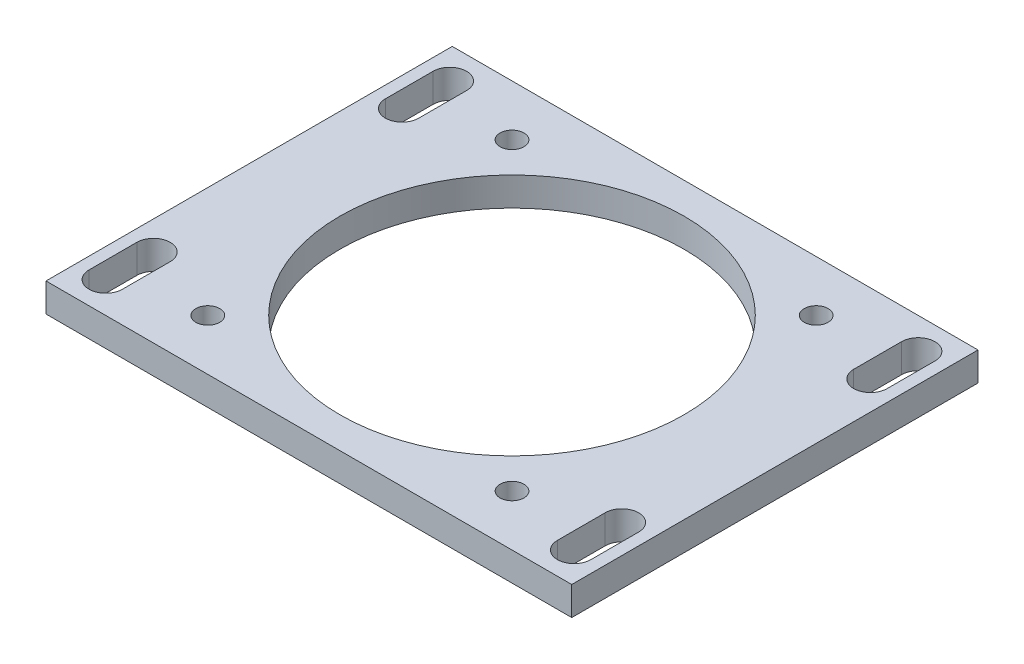
ISO-10303-21;
HEADER;
FILE_DESCRIPTION(('STEP AP214'),'2;1');
FILE_NAME('part.step','',(''),(''),'','','');
FILE_SCHEMA(('AUTOMOTIVE_DESIGN { 1 0 10303 214 1 1 1 1 }'));
ENDSEC;
DATA;
#1=APPLICATION_CONTEXT('core data for automotive mechanical design processes');
#2=APPLICATION_PROTOCOL_DEFINITION('international standard','automotive_design',2000,#1);
#3=PRODUCT_CONTEXT('',#1,'mechanical');
#4=PRODUCT('Part','Part','',(#3));
#5=PRODUCT_RELATED_PRODUCT_CATEGORY('part','',(#4));
#6=PRODUCT_DEFINITION_FORMATION('','',#4);
#7=PRODUCT_DEFINITION_CONTEXT('part definition',#1,'design');
#8=PRODUCT_DEFINITION('design','',#6,#7);
#9=PRODUCT_DEFINITION_SHAPE('','',#8);
#10=(LENGTH_UNIT() NAMED_UNIT(*) SI_UNIT(.MILLI.,.METRE.));
#11=(NAMED_UNIT(*) PLANE_ANGLE_UNIT() SI_UNIT($,.RADIAN.));
#12=(NAMED_UNIT(*) SI_UNIT($,.STERADIAN.) SOLID_ANGLE_UNIT());
#13=UNCERTAINTY_MEASURE_WITH_UNIT(LENGTH_MEASURE(1.E-05),#10,'distance_accuracy_value','');
#14=(GEOMETRIC_REPRESENTATION_CONTEXT(3) GLOBAL_UNCERTAINTY_ASSIGNED_CONTEXT((#13)) GLOBAL_UNIT_ASSIGNED_CONTEXT((#10,
#11,#12)) REPRESENTATION_CONTEXT('',''));
#15=CARTESIAN_POINT('',(0.,0.,0.));
#16=DIRECTION('',(0.,0.,1.));
#17=DIRECTION('',(1.,0.,0.));
#18=AXIS2_PLACEMENT_3D('',#15,#16,#17);
#19=CARTESIAN_POINT('',(55.,6.,-42.5));
#20=DIRECTION('',(-1.,0.,0.));
#21=DIRECTION('',(0.,0.,1.));
#22=AXIS2_PLACEMENT_3D('',#19,#20,#21);
#23=PLANE('',#22);
#24=DIRECTION('',(0.,0.,-1.));
#25=VECTOR('',#24,1.);
#26=CARTESIAN_POINT('',(55.,0.,-42.5));
#27=LINE('',#26,#25);
#28=CARTESIAN_POINT('',(55.,0.,42.5));
#29=VERTEX_POINT('',#28);
#30=CARTESIAN_POINT('',(55.,0.,-42.5));
#31=VERTEX_POINT('',#30);
#32=EDGE_CURVE('E288',#29,#31,#27,.T.);
#33=ORIENTED_EDGE('',*,*,#32,.T.);
#34=DIRECTION('',(0.,-1.,0.));
#35=VECTOR('',#34,1.);
#36=CARTESIAN_POINT('',(55.,6.,-42.5));
#37=LINE('',#36,#35);
#38=CARTESIAN_POINT('',(55.,6.,-42.5));
#39=VERTEX_POINT('',#38);
#40=EDGE_CURVE('E304',#39,#31,#37,.T.);
#41=ORIENTED_EDGE('',*,*,#40,.F.);
#42=DIRECTION('',(0.,0.,-1.));
#43=VECTOR('',#42,1.);
#44=CARTESIAN_POINT('',(55.,6.,-42.5));
#45=LINE('',#44,#43);
#46=CARTESIAN_POINT('',(55.,6.,42.5));
#47=VERTEX_POINT('',#46);
#48=EDGE_CURVE('E277',#47,#39,#45,.T.);
#49=ORIENTED_EDGE('',*,*,#48,.F.);
#50=DIRECTION('',(0.,-1.,0.));
#51=VECTOR('',#50,1.);
#52=CARTESIAN_POINT('',(55.,6.,42.5));
#53=LINE('',#52,#51);
#54=EDGE_CURVE('E287',#47,#29,#53,.T.);
#55=ORIENTED_EDGE('',*,*,#54,.T.);
#56=EDGE_LOOP('',(#33,#41,#49,#55));
#57=FACE_BOUND('',#56,.T.);
#58=ADVANCED_FACE('F42',(#57),#23,.F.);
#59=CARTESIAN_POINT('',(-55.,6.,-42.5));
#60=DIRECTION('',(0.,0.,1.));
#61=DIRECTION('',(1.,0.,0.));
#62=AXIS2_PLACEMENT_3D('',#59,#60,#61);
#63=PLANE('',#62);
#64=DIRECTION('',(-1.,0.,0.));
#65=VECTOR('',#64,1.);
#66=CARTESIAN_POINT('',(-55.,0.,-42.5));
#67=LINE('',#66,#65);
#68=CARTESIAN_POINT('',(-55.,0.,-42.5));
#69=VERTEX_POINT('',#68);
#70=EDGE_CURVE('E291',#31,#69,#67,.T.);
#71=ORIENTED_EDGE('',*,*,#70,.T.);
#72=DIRECTION('',(0.,-1.,0.));
#73=VECTOR('',#72,1.);
#74=CARTESIAN_POINT('',(-55.,6.,-42.5));
#75=LINE('',#74,#73);
#76=CARTESIAN_POINT('',(-55.,6.,-42.5));
#77=VERTEX_POINT('',#76);
#78=EDGE_CURVE('E301',#77,#69,#75,.T.);
#79=ORIENTED_EDGE('',*,*,#78,.F.);
#80=DIRECTION('',(-1.,0.,0.));
#81=VECTOR('',#80,1.);
#82=CARTESIAN_POINT('',(-55.,6.,-42.5));
#83=LINE('',#82,#81);
#84=EDGE_CURVE('E280',#39,#77,#83,.T.);
#85=ORIENTED_EDGE('',*,*,#84,.F.);
#86=ORIENTED_EDGE('',*,*,#40,.T.);
#87=EDGE_LOOP('',(#71,#79,#85,#86));
#88=FACE_BOUND('',#87,.T.);
#89=ADVANCED_FACE('F404',(#88),#63,.F.);
#90=CARTESIAN_POINT('',(-55.,6.,-42.5));
#91=DIRECTION('',(1.,0.,0.));
#92=DIRECTION('',(0.,0.,-1.));
#93=AXIS2_PLACEMENT_3D('',#90,#91,#92);
#94=PLANE('',#93);
#95=DIRECTION('',(0.,0.,1.));
#96=VECTOR('',#95,1.);
#97=CARTESIAN_POINT('',(-55.,0.,-42.5));
#98=LINE('',#97,#96);
#99=CARTESIAN_POINT('',(-55.,0.,42.5));
#100=VERTEX_POINT('',#99);
#101=EDGE_CURVE('E293',#69,#100,#98,.T.);
#102=ORIENTED_EDGE('',*,*,#101,.T.);
#103=DIRECTION('',(0.,-1.,0.));
#104=VECTOR('',#103,1.);
#105=CARTESIAN_POINT('',(-55.,6.,42.5));
#106=LINE('',#105,#104);
#107=CARTESIAN_POINT('',(-55.,6.,42.5));
#108=VERTEX_POINT('',#107);
#109=EDGE_CURVE('E298',#108,#100,#106,.T.);
#110=ORIENTED_EDGE('',*,*,#109,.F.);
#111=DIRECTION('',(0.,0.,1.));
#112=VECTOR('',#111,1.);
#113=CARTESIAN_POINT('',(-55.,6.,-42.5));
#114=LINE('',#113,#112);
#115=EDGE_CURVE('E283',#77,#108,#114,.T.);
#116=ORIENTED_EDGE('',*,*,#115,.F.);
#117=ORIENTED_EDGE('',*,*,#78,.T.);
#118=EDGE_LOOP('',(#102,#110,#116,#117));
#119=FACE_BOUND('',#118,.T.);
#120=ADVANCED_FACE('F401',(#119),#94,.F.);
#121=CARTESIAN_POINT('',(-55.,6.,42.5));
#122=DIRECTION('',(0.,0.,-1.));
#123=DIRECTION('',(-1.,0.,0.));
#124=AXIS2_PLACEMENT_3D('',#121,#122,#123);
#125=PLANE('',#124);
#126=DIRECTION('',(1.,0.,0.));
#127=VECTOR('',#126,1.);
#128=CARTESIAN_POINT('',(-55.,0.,42.5));
#129=LINE('',#128,#127);
#130=EDGE_CURVE('E281',#100,#29,#129,.T.);
#131=ORIENTED_EDGE('',*,*,#130,.T.);
#132=ORIENTED_EDGE('',*,*,#54,.F.);
#133=DIRECTION('',(1.,0.,0.));
#134=VECTOR('',#133,1.);
#135=CARTESIAN_POINT('',(-55.,6.,42.5));
#136=LINE('',#135,#134);
#137=EDGE_CURVE('E285',#108,#47,#136,.T.);
#138=ORIENTED_EDGE('',*,*,#137,.F.);
#139=ORIENTED_EDGE('',*,*,#109,.T.);
#140=EDGE_LOOP('',(#131,#132,#138,#139));
#141=FACE_BOUND('',#140,.T.);
#142=ADVANCED_FACE('F397',(#141),#125,.F.);
#143=CARTESIAN_POINT('',(0.,6.,0.));
#144=DIRECTION('',(0.,1.,0.));
#145=DIRECTION('',(0.,0.,1.));
#146=AXIS2_PLACEMENT_3D('',#143,#144,#145);
#147=PLANE('',#146);
#148=CARTESIAN_POINT('',(-31.8198051533947,6.,-31.8198051533946));
#149=DIRECTION('',(0.,1.,0.));
#150=DIRECTION('',(0.,0.,1.));
#151=AXIS2_PLACEMENT_3D('',#148,#149,#150);
#152=CIRCLE('',#151,2.49999999999999);
#153=CARTESIAN_POINT('',(-31.8198051533947,6.,-29.3198051533946));
#154=VERTEX_POINT('',#153);
#155=EDGE_CURVE('E369',#154,#154,#152,.T.);
#156=ORIENTED_EDGE('',*,*,#155,.F.);
#157=EDGE_LOOP('',(#156));
#158=FACE_BOUND('',#157,.T.);
#159=CARTESIAN_POINT('',(31.8198051533947,6.,-31.8198051533946));
#160=DIRECTION('',(0.,1.,0.));
#161=DIRECTION('',(0.,0.,1.));
#162=AXIS2_PLACEMENT_3D('',#159,#160,#161);
#163=CIRCLE('',#162,2.49999999999999);
#164=CARTESIAN_POINT('',(31.8198051533947,6.,-29.3198051533946));
#165=VERTEX_POINT('',#164);
#166=EDGE_CURVE('E359',#165,#165,#163,.T.);
#167=ORIENTED_EDGE('',*,*,#166,.F.);
#168=EDGE_LOOP('',(#167));
#169=FACE_BOUND('',#168,.T.);
#170=CARTESIAN_POINT('',(31.8198051533945,6.,31.8198051533948));
#171=DIRECTION('',(0.,1.,0.));
#172=DIRECTION('',(0.,0.,1.));
#173=AXIS2_PLACEMENT_3D('',#170,#171,#172);
#174=CIRCLE('',#173,2.49999999999999);
#175=CARTESIAN_POINT('',(31.8198051533945,6.,34.3198051533948));
#176=VERTEX_POINT('',#175);
#177=EDGE_CURVE('E356',#176,#176,#174,.T.);
#178=ORIENTED_EDGE('',*,*,#177,.F.);
#179=EDGE_LOOP('',(#178));
#180=FACE_BOUND('',#179,.T.);
#181=CARTESIAN_POINT('',(-31.8198051533945,6.,31.8198051533948));
#182=DIRECTION('',(0.,1.,0.));
#183=DIRECTION('',(0.,0.,1.));
#184=AXIS2_PLACEMENT_3D('',#181,#182,#183);
#185=CIRCLE('',#184,2.49999999999999);
#186=CARTESIAN_POINT('',(-31.8198051533945,6.,34.3198051533948));
#187=VERTEX_POINT('',#186);
#188=EDGE_CURVE('E353',#187,#187,#185,.T.);
#189=ORIENTED_EDGE('',*,*,#188,.F.);
#190=EDGE_LOOP('',(#189));
#191=FACE_BOUND('',#190,.T.);
#192=CARTESIAN_POINT('',(49.,6.,-36.));
#193=DIRECTION('',(0.,1.,0.));
#194=DIRECTION('',(0.,0.,-1.));
#195=AXIS2_PLACEMENT_3D('',#192,#193,#194);
#196=CIRCLE('',#195,3.49999999999999);
#197=CARTESIAN_POINT('',(52.5,6.,-36.));
#198=VERTEX_POINT('',#197);
#199=CARTESIAN_POINT('',(45.5,6.,-36.));
#200=VERTEX_POINT('',#199);
#201=EDGE_CURVE('E58',#198,#200,#196,.T.);
#202=ORIENTED_EDGE('',*,*,#201,.F.);
#203=DIRECTION('',(0.,0.,-1.));
#204=VECTOR('',#203,1.);
#205=CARTESIAN_POINT('',(52.5,6.,-36.));
#206=LINE('',#205,#204);
#207=CARTESIAN_POINT('',(52.5,6.,-26.));
#208=VERTEX_POINT('',#207);
#209=EDGE_CURVE('E225',#208,#198,#206,.T.);
#210=ORIENTED_EDGE('',*,*,#209,.F.);
#211=CARTESIAN_POINT('',(49.,6.,-26.));
#212=DIRECTION('',(0.,1.,0.));
#213=DIRECTION('',(0.,0.,-1.));
#214=AXIS2_PLACEMENT_3D('',#211,#212,#213);
#215=CIRCLE('',#214,3.5);
#216=CARTESIAN_POINT('',(45.5,6.,-26.));
#217=VERTEX_POINT('',#216);
#218=EDGE_CURVE('E222',#217,#208,#215,.T.);
#219=ORIENTED_EDGE('',*,*,#218,.F.);
#220=DIRECTION('',(0.,0.,1.));
#221=VECTOR('',#220,1.);
#222=CARTESIAN_POINT('',(45.5,6.,-36.));
#223=LINE('',#222,#221);
#224=EDGE_CURVE('E218',#200,#217,#223,.T.);
#225=ORIENTED_EDGE('',*,*,#224,.F.);
#226=EDGE_LOOP('',(#202,#210,#219,#225));
#227=FACE_BOUND('',#226,.T.);
#228=CARTESIAN_POINT('',(-49.,6.,36.));
#229=DIRECTION('',(0.,1.,0.));
#230=DIRECTION('',(0.,0.,-1.));
#231=AXIS2_PLACEMENT_3D('',#228,#229,#230);
#232=CIRCLE('',#231,3.49999999999999);
#233=CARTESIAN_POINT('',(-52.5,6.,36.));
#234=VERTEX_POINT('',#233);
#235=CARTESIAN_POINT('',(-45.5,6.,36.));
#236=VERTEX_POINT('',#235);
#237=EDGE_CURVE('E66',#234,#236,#232,.T.);
#238=ORIENTED_EDGE('',*,*,#237,.F.);
#239=DIRECTION('',(0.,0.,1.));
#240=VECTOR('',#239,1.);
#241=CARTESIAN_POINT('',(-52.5,6.,36.));
#242=LINE('',#241,#240);
#243=CARTESIAN_POINT('',(-52.5,6.,26.));
#244=VERTEX_POINT('',#243);
#245=EDGE_CURVE('E244',#244,#234,#242,.T.);
#246=ORIENTED_EDGE('',*,*,#245,.F.);
#247=CARTESIAN_POINT('',(-49.,6.,26.));
#248=DIRECTION('',(0.,1.,0.));
#249=DIRECTION('',(0.,0.,-1.));
#250=AXIS2_PLACEMENT_3D('',#247,#248,#249);
#251=CIRCLE('',#250,3.5);
#252=CARTESIAN_POINT('',(-45.5,6.,26.));
#253=VERTEX_POINT('',#252);
#254=EDGE_CURVE('E241',#253,#244,#251,.T.);
#255=ORIENTED_EDGE('',*,*,#254,.F.);
#256=DIRECTION('',(0.,0.,-1.));
#257=VECTOR('',#256,1.);
#258=CARTESIAN_POINT('',(-45.5,6.,36.));
#259=LINE('',#258,#257);
#260=EDGE_CURVE('E238',#236,#253,#259,.T.);
#261=ORIENTED_EDGE('',*,*,#260,.F.);
#262=EDGE_LOOP('',(#238,#246,#255,#261));
#263=FACE_BOUND('',#262,.T.);
#264=CARTESIAN_POINT('',(49.,6.,36.));
#265=DIRECTION('',(0.,1.,0.));
#266=DIRECTION('',(0.,0.,1.));
#267=AXIS2_PLACEMENT_3D('',#264,#265,#266);
#268=CIRCLE('',#267,3.49999999999999);
#269=CARTESIAN_POINT('',(45.5,6.,36.));
#270=VERTEX_POINT('',#269);
#271=CARTESIAN_POINT('',(52.5,6.,36.));
#272=VERTEX_POINT('',#271);
#273=EDGE_CURVE('E203',#270,#272,#268,.T.);
#274=ORIENTED_EDGE('',*,*,#273,.F.);
#275=DIRECTION('',(0.,0.,1.));
#276=VECTOR('',#275,1.);
#277=CARTESIAN_POINT('',(45.5,6.,36.));
#278=LINE('',#277,#276);
#279=CARTESIAN_POINT('',(45.5,6.,26.));
#280=VERTEX_POINT('',#279);
#281=EDGE_CURVE('E208',#280,#270,#278,.T.);
#282=ORIENTED_EDGE('',*,*,#281,.F.);
#283=CARTESIAN_POINT('',(49.,6.,26.));
#284=DIRECTION('',(0.,1.,0.));
#285=DIRECTION('',(0.,0.,1.));
#286=AXIS2_PLACEMENT_3D('',#283,#284,#285);
#287=CIRCLE('',#286,3.5);
#288=CARTESIAN_POINT('',(52.5,6.,26.));
#289=VERTEX_POINT('',#288);
#290=EDGE_CURVE('E187',#289,#280,#287,.T.);
#291=ORIENTED_EDGE('',*,*,#290,.F.);
#292=DIRECTION('',(0.,0.,-1.));
#293=VECTOR('',#292,1.);
#294=CARTESIAN_POINT('',(52.5,6.,36.));
#295=LINE('',#294,#293);
#296=EDGE_CURVE('E198',#272,#289,#295,.T.);
#297=ORIENTED_EDGE('',*,*,#296,.F.);
#298=EDGE_LOOP('',(#274,#282,#291,#297));
#299=FACE_BOUND('',#298,.T.);
#300=CARTESIAN_POINT('',(-49.,6.,-36.));
#301=DIRECTION('',(0.,1.,0.));
#302=DIRECTION('',(0.,0.,1.));
#303=AXIS2_PLACEMENT_3D('',#300,#301,#302);
#304=CIRCLE('',#303,3.49999999999999);
#305=CARTESIAN_POINT('',(-45.5,6.,-36.));
#306=VERTEX_POINT('',#305);
#307=CARTESIAN_POINT('',(-52.5,6.,-36.));
#308=VERTEX_POINT('',#307);
#309=EDGE_CURVE('E231',#306,#308,#304,.T.);
#310=ORIENTED_EDGE('',*,*,#309,.F.);
#311=DIRECTION('',(0.,0.,-1.));
#312=VECTOR('',#311,1.);
#313=CARTESIAN_POINT('',(-45.5,6.,-36.));
#314=LINE('',#313,#312);
#315=CARTESIAN_POINT('',(-45.5,6.,-26.));
#316=VERTEX_POINT('',#315);
#317=EDGE_CURVE('E261',#316,#306,#314,.T.);
#318=ORIENTED_EDGE('',*,*,#317,.F.);
#319=CARTESIAN_POINT('',(-49.,6.,-26.));
#320=DIRECTION('',(0.,1.,0.));
#321=DIRECTION('',(0.,0.,1.));
#322=AXIS2_PLACEMENT_3D('',#319,#320,#321);
#323=CIRCLE('',#322,3.5);
#324=CARTESIAN_POINT('',(-52.5,6.,-26.));
#325=VERTEX_POINT('',#324);
#326=EDGE_CURVE('E258',#325,#316,#323,.T.);
#327=ORIENTED_EDGE('',*,*,#326,.F.);
#328=DIRECTION('',(0.,0.,1.));
#329=VECTOR('',#328,1.);
#330=CARTESIAN_POINT('',(-52.5,6.,-36.));
#331=LINE('',#330,#329);
#332=EDGE_CURVE('E255',#308,#325,#331,.T.);
#333=ORIENTED_EDGE('',*,*,#332,.F.);
#334=EDGE_LOOP('',(#310,#318,#327,#333));
#335=FACE_BOUND('',#334,.T.);
#336=CARTESIAN_POINT('',(0.,6.,0.));
#337=DIRECTION('',(0.,1.,0.));
#338=DIRECTION('',(0.,0.,1.));
#339=AXIS2_PLACEMENT_3D('',#336,#337,#338);
#340=CIRCLE('',#339,36.);
#341=CARTESIAN_POINT('',(0.,6.,36.));
#342=VERTEX_POINT('',#341);
#343=EDGE_CURVE('E267',#342,#342,#340,.T.);
#344=ORIENTED_EDGE('',*,*,#343,.F.);
#345=EDGE_LOOP('',(#344));
#346=FACE_BOUND('',#345,.T.);
#347=ORIENTED_EDGE('',*,*,#48,.T.);
#348=ORIENTED_EDGE('',*,*,#84,.T.);
#349=ORIENTED_EDGE('',*,*,#115,.T.);
#350=ORIENTED_EDGE('',*,*,#137,.T.);
#351=EDGE_LOOP('',(#347,#348,#349,#350));
#352=FACE_BOUND('',#351,.T.);
#353=ADVANCED_FACE('F205',(#158,#169,#180,#191,#227,#263,#299,#335,#346,#352),#147,.T.);
#354=CARTESIAN_POINT('',(0.,0.,0.));
#355=DIRECTION('',(0.,1.,0.));
#356=DIRECTION('',(0.,0.,1.));
#357=AXIS2_PLACEMENT_3D('',#354,#355,#356);
#358=PLANE('',#357);
#359=CARTESIAN_POINT('',(-31.8198051533947,0.,-31.8198051533946));
#360=DIRECTION('',(0.,1.,0.));
#361=DIRECTION('',(0.,0.,1.));
#362=AXIS2_PLACEMENT_3D('',#359,#360,#361);
#363=CIRCLE('',#362,2.49999999999999);
#364=CARTESIAN_POINT('',(-31.8198051533947,0.,-29.3198051533946));
#365=VERTEX_POINT('',#364);
#366=EDGE_CURVE('E45',#365,#365,#363,.T.);
#367=ORIENTED_EDGE('',*,*,#366,.T.);
#368=EDGE_LOOP('',(#367));
#369=FACE_BOUND('',#368,.T.);
#370=CARTESIAN_POINT('',(31.8198051533947,0.,-31.8198051533946));
#371=DIRECTION('',(0.,1.,0.));
#372=DIRECTION('',(0.,0.,1.));
#373=AXIS2_PLACEMENT_3D('',#370,#371,#372);
#374=CIRCLE('',#373,2.49999999999999);
#375=CARTESIAN_POINT('',(31.8198051533947,0.,-29.3198051533946));
#376=VERTEX_POINT('',#375);
#377=EDGE_CURVE('E357',#376,#376,#374,.T.);
#378=ORIENTED_EDGE('',*,*,#377,.T.);
#379=EDGE_LOOP('',(#378));
#380=FACE_BOUND('',#379,.T.);
#381=CARTESIAN_POINT('',(31.8198051533945,0.,31.8198051533948));
#382=DIRECTION('',(0.,1.,0.));
#383=DIRECTION('',(0.,0.,1.));
#384=AXIS2_PLACEMENT_3D('',#381,#382,#383);
#385=CIRCLE('',#384,2.49999999999999);
#386=CARTESIAN_POINT('',(31.8198051533945,0.,34.3198051533948));
#387=VERTEX_POINT('',#386);
#388=EDGE_CURVE('E354',#387,#387,#385,.T.);
#389=ORIENTED_EDGE('',*,*,#388,.T.);
#390=EDGE_LOOP('',(#389));
#391=FACE_BOUND('',#390,.T.);
#392=CARTESIAN_POINT('',(-31.8198051533945,0.,31.8198051533948));
#393=DIRECTION('',(0.,1.,0.));
#394=DIRECTION('',(0.,0.,1.));
#395=AXIS2_PLACEMENT_3D('',#392,#393,#394);
#396=CIRCLE('',#395,2.49999999999999);
#397=CARTESIAN_POINT('',(-31.8198051533945,0.,34.3198051533948));
#398=VERTEX_POINT('',#397);
#399=EDGE_CURVE('E350',#398,#398,#396,.T.);
#400=ORIENTED_EDGE('',*,*,#399,.T.);
#401=EDGE_LOOP('',(#400));
#402=FACE_BOUND('',#401,.T.);
#403=DIRECTION('',(0.,0.,-1.));
#404=VECTOR('',#403,1.);
#405=CARTESIAN_POINT('',(52.5,0.,0.));
#406=LINE('',#405,#404);
#407=CARTESIAN_POINT('',(52.5,0.,-26.));
#408=VERTEX_POINT('',#407);
#409=CARTESIAN_POINT('',(52.5,0.,-36.));
#410=VERTEX_POINT('',#409);
#411=EDGE_CURVE('E50',#408,#410,#406,.T.);
#412=ORIENTED_EDGE('',*,*,#411,.T.);
#413=CARTESIAN_POINT('',(49.,0.,-36.));
#414=DIRECTION('',(0.,1.,0.));
#415=DIRECTION('',(0.,0.,1.));
#416=AXIS2_PLACEMENT_3D('',#413,#414,#415);
#417=CIRCLE('',#416,3.49999999999999);
#418=CARTESIAN_POINT('',(45.5,0.,-36.));
#419=VERTEX_POINT('',#418);
#420=EDGE_CURVE('E11',#410,#419,#417,.T.);
#421=ORIENTED_EDGE('',*,*,#420,.T.);
#422=DIRECTION('',(0.,0.,1.));
#423=VECTOR('',#422,1.);
#424=CARTESIAN_POINT('',(45.5,0.,0.));
#425=LINE('',#424,#423);
#426=CARTESIAN_POINT('',(45.5,0.,-26.));
#427=VERTEX_POINT('',#426);
#428=EDGE_CURVE('E342',#419,#427,#425,.T.);
#429=ORIENTED_EDGE('',*,*,#428,.T.);
#430=CARTESIAN_POINT('',(49.,0.,-26.));
#431=DIRECTION('',(0.,1.,0.));
#432=DIRECTION('',(0.,0.,1.));
#433=AXIS2_PLACEMENT_3D('',#430,#431,#432);
#434=CIRCLE('',#433,3.5);
#435=EDGE_CURVE('E345',#427,#408,#434,.T.);
#436=ORIENTED_EDGE('',*,*,#435,.T.);
#437=EDGE_LOOP('',(#412,#421,#429,#436));
#438=FACE_BOUND('',#437,.T.);
#439=DIRECTION('',(0.,0.,1.));
#440=VECTOR('',#439,1.);
#441=CARTESIAN_POINT('',(-52.5,0.,0.));
#442=LINE('',#441,#440);
#443=CARTESIAN_POINT('',(-52.5,0.,26.));
#444=VERTEX_POINT('',#443);
#445=CARTESIAN_POINT('',(-52.5,0.,36.));
#446=VERTEX_POINT('',#445);
#447=EDGE_CURVE('E336',#444,#446,#442,.T.);
#448=ORIENTED_EDGE('',*,*,#447,.T.);
#449=CARTESIAN_POINT('',(-49.,0.,36.));
#450=DIRECTION('',(0.,1.,0.));
#451=DIRECTION('',(0.,0.,1.));
#452=AXIS2_PLACEMENT_3D('',#449,#450,#451);
#453=CIRCLE('',#452,3.49999999999999);
#454=CARTESIAN_POINT('',(-45.5,0.,36.));
#455=VERTEX_POINT('',#454);
#456=EDGE_CURVE('E339',#446,#455,#453,.T.);
#457=ORIENTED_EDGE('',*,*,#456,.T.);
#458=DIRECTION('',(0.,0.,-1.));
#459=VECTOR('',#458,1.);
#460=CARTESIAN_POINT('',(-45.5,0.,0.));
#461=LINE('',#460,#459);
#462=CARTESIAN_POINT('',(-45.5,0.,26.));
#463=VERTEX_POINT('',#462);
#464=EDGE_CURVE('E330',#455,#463,#461,.T.);
#465=ORIENTED_EDGE('',*,*,#464,.T.);
#466=CARTESIAN_POINT('',(-49.,0.,26.));
#467=DIRECTION('',(0.,1.,0.));
#468=DIRECTION('',(0.,0.,1.));
#469=AXIS2_PLACEMENT_3D('',#466,#467,#468);
#470=CIRCLE('',#469,3.5);
#471=EDGE_CURVE('E333',#463,#444,#470,.T.);
#472=ORIENTED_EDGE('',*,*,#471,.T.);
#473=EDGE_LOOP('',(#448,#457,#465,#472));
#474=FACE_BOUND('',#473,.T.);
#475=DIRECTION('',(0.,0.,1.));
#476=VECTOR('',#475,1.);
#477=CARTESIAN_POINT('',(45.5,0.,0.));
#478=LINE('',#477,#476);
#479=CARTESIAN_POINT('',(45.5,0.,26.));
#480=VERTEX_POINT('',#479);
#481=CARTESIAN_POINT('',(45.5,0.,36.));
#482=VERTEX_POINT('',#481);
#483=EDGE_CURVE('E324',#480,#482,#478,.T.);
#484=ORIENTED_EDGE('',*,*,#483,.T.);
#485=CARTESIAN_POINT('',(49.,0.,36.));
#486=DIRECTION('',(0.,1.,0.));
#487=DIRECTION('',(0.,0.,1.));
#488=AXIS2_PLACEMENT_3D('',#485,#486,#487);
#489=CIRCLE('',#488,3.49999999999999);
#490=CARTESIAN_POINT('',(52.5,0.,36.));
#491=VERTEX_POINT('',#490);
#492=EDGE_CURVE('E327',#482,#491,#489,.T.);
#493=ORIENTED_EDGE('',*,*,#492,.T.);
#494=DIRECTION('',(0.,0.,-1.));
#495=VECTOR('',#494,1.);
#496=CARTESIAN_POINT('',(52.5,0.,0.));
#497=LINE('',#496,#495);
#498=CARTESIAN_POINT('',(52.5,0.,26.));
#499=VERTEX_POINT('',#498);
#500=EDGE_CURVE('E321',#491,#499,#497,.T.);
#501=ORIENTED_EDGE('',*,*,#500,.T.);
#502=CARTESIAN_POINT('',(49.,0.,26.));
#503=DIRECTION('',(0.,1.,0.));
#504=DIRECTION('',(0.,0.,1.));
#505=AXIS2_PLACEMENT_3D('',#502,#503,#504);
#506=CIRCLE('',#505,3.5);
#507=EDGE_CURVE('E190',#499,#480,#506,.T.);
#508=ORIENTED_EDGE('',*,*,#507,.T.);
#509=EDGE_LOOP('',(#484,#493,#501,#508));
#510=FACE_BOUND('',#509,.T.);
#511=DIRECTION('',(0.,0.,-1.));
#512=VECTOR('',#511,1.);
#513=CARTESIAN_POINT('',(-45.5,0.,0.));
#514=LINE('',#513,#512);
#515=CARTESIAN_POINT('',(-45.5,0.,-26.));
#516=VERTEX_POINT('',#515);
#517=CARTESIAN_POINT('',(-45.5,0.,-36.));
#518=VERTEX_POINT('',#517);
#519=EDGE_CURVE('E315',#516,#518,#514,.T.);
#520=ORIENTED_EDGE('',*,*,#519,.T.);
#521=CARTESIAN_POINT('',(-49.,0.,-36.));
#522=DIRECTION('',(0.,1.,0.));
#523=DIRECTION('',(0.,0.,1.));
#524=AXIS2_PLACEMENT_3D('',#521,#522,#523);
#525=CIRCLE('',#524,3.49999999999999);
#526=CARTESIAN_POINT('',(-52.5,0.,-36.));
#527=VERTEX_POINT('',#526);
#528=EDGE_CURVE('E318',#518,#527,#525,.T.);
#529=ORIENTED_EDGE('',*,*,#528,.T.);
#530=DIRECTION('',(0.,0.,1.));
#531=VECTOR('',#530,1.);
#532=CARTESIAN_POINT('',(-52.5,0.,0.));
#533=LINE('',#532,#531);
#534=CARTESIAN_POINT('',(-52.5,0.,-26.));
#535=VERTEX_POINT('',#534);
#536=EDGE_CURVE('E307',#527,#535,#533,.T.);
#537=ORIENTED_EDGE('',*,*,#536,.T.);
#538=CARTESIAN_POINT('',(-49.,0.,-26.));
#539=DIRECTION('',(0.,1.,0.));
#540=DIRECTION('',(0.,0.,1.));
#541=AXIS2_PLACEMENT_3D('',#538,#539,#540);
#542=CIRCLE('',#541,3.5);
#543=EDGE_CURVE('E312',#535,#516,#542,.T.);
#544=ORIENTED_EDGE('',*,*,#543,.T.);
#545=EDGE_LOOP('',(#520,#529,#537,#544));
#546=FACE_BOUND('',#545,.T.);
#547=CARTESIAN_POINT('',(0.,0.,0.));
#548=DIRECTION('',(0.,1.,0.));
#549=DIRECTION('',(0.,0.,1.));
#550=AXIS2_PLACEMENT_3D('',#547,#548,#549);
#551=CIRCLE('',#550,36.);
#552=CARTESIAN_POINT('',(0.,0.,36.));
#553=VERTEX_POINT('',#552);
#554=EDGE_CURVE('E276',#553,#553,#551,.T.);
#555=ORIENTED_EDGE('',*,*,#554,.T.);
#556=EDGE_LOOP('',(#555));
#557=FACE_BOUND('',#556,.T.);
#558=ORIENTED_EDGE('',*,*,#32,.F.);
#559=ORIENTED_EDGE('',*,*,#130,.F.);
#560=ORIENTED_EDGE('',*,*,#101,.F.);
#561=ORIENTED_EDGE('',*,*,#70,.F.);
#562=EDGE_LOOP('',(#558,#559,#560,#561));
#563=FACE_BOUND('',#562,.T.);
#564=ADVANCED_FACE('F379',(#369,#380,#391,#402,#438,#474,#510,#546,#557,#563),#358,.F.);
#565=CARTESIAN_POINT('',(0.,-4.,0.));
#566=DIRECTION('',(0.,1.,0.));
#567=DIRECTION('',(0.,0.,1.));
#568=AXIS2_PLACEMENT_3D('',#565,#566,#567);
#569=CYLINDRICAL_SURFACE('',#568,36.);
#570=ORIENTED_EDGE('',*,*,#343,.T.);
#571=EDGE_LOOP('',(#570));
#572=FACE_BOUND('',#571,.T.);
#573=ORIENTED_EDGE('',*,*,#554,.F.);
#574=EDGE_LOOP('',(#573));
#575=FACE_BOUND('',#574,.T.);
#576=ADVANCED_FACE('F382',(#572,#575),#569,.F.);
#577=CARTESIAN_POINT('',(-49.,-4.,-36.));
#578=DIRECTION('',(0.,1.,0.));
#579=DIRECTION('',(0.,0.,1.));
#580=AXIS2_PLACEMENT_3D('',#577,#578,#579);
#581=CYLINDRICAL_SURFACE('',#580,3.49999999999999);
#582=DIRECTION('',(0.,1.,0.));
#583=VECTOR('',#582,1.);
#584=CARTESIAN_POINT('',(-45.5,-4.,-36.));
#585=LINE('',#584,#583);
#586=EDGE_CURVE('E265',#518,#306,#585,.T.);
#587=ORIENTED_EDGE('',*,*,#586,.T.);
#588=ORIENTED_EDGE('',*,*,#309,.T.);
#589=DIRECTION('',(0.,1.,0.));
#590=VECTOR('',#589,1.);
#591=CARTESIAN_POINT('',(-52.5,-4.,-36.));
#592=LINE('',#591,#590);
#593=EDGE_CURVE('E264',#527,#308,#592,.T.);
#594=ORIENTED_EDGE('',*,*,#593,.F.);
#595=ORIENTED_EDGE('',*,*,#528,.F.);
#596=EDGE_LOOP('',(#587,#588,#594,#595));
#597=FACE_BOUND('',#596,.T.);
#598=ADVANCED_FACE('F440',(#597),#581,.F.);
#599=CARTESIAN_POINT('',(-45.5,-4.,-36.));
#600=DIRECTION('',(1.,0.,0.));
#601=DIRECTION('',(0.,0.,-1.));
#602=AXIS2_PLACEMENT_3D('',#599,#600,#601);
#603=PLANE('',#602);
#604=DIRECTION('',(0.,1.,0.));
#605=VECTOR('',#604,1.);
#606=CARTESIAN_POINT('',(-45.5,-4.,-26.));
#607=LINE('',#606,#605);
#608=EDGE_CURVE('E268',#516,#316,#607,.T.);
#609=ORIENTED_EDGE('',*,*,#608,.T.);
#610=ORIENTED_EDGE('',*,*,#317,.T.);
#611=ORIENTED_EDGE('',*,*,#586,.F.);
#612=ORIENTED_EDGE('',*,*,#519,.F.);
#613=EDGE_LOOP('',(#609,#610,#611,#612));
#614=FACE_BOUND('',#613,.T.);
#615=ADVANCED_FACE('F450',(#614),#603,.F.);
#616=CARTESIAN_POINT('',(-49.,-4.,-26.));
#617=DIRECTION('',(0.,1.,0.));
#618=DIRECTION('',(0.,0.,1.));
#619=AXIS2_PLACEMENT_3D('',#616,#617,#618);
#620=CYLINDRICAL_SURFACE('',#619,3.5);
#621=DIRECTION('',(0.,1.,0.));
#622=VECTOR('',#621,1.);
#623=CARTESIAN_POINT('',(-52.5,-4.,-26.));
#624=LINE('',#623,#622);
#625=EDGE_CURVE('E270',#535,#325,#624,.T.);
#626=ORIENTED_EDGE('',*,*,#625,.T.);
#627=ORIENTED_EDGE('',*,*,#326,.T.);
#628=ORIENTED_EDGE('',*,*,#608,.F.);
#629=ORIENTED_EDGE('',*,*,#543,.F.);
#630=EDGE_LOOP('',(#626,#627,#628,#629));
#631=FACE_BOUND('',#630,.T.);
#632=ADVANCED_FACE('F460',(#631),#620,.F.);
#633=CARTESIAN_POINT('',(-52.5,-4.,-36.));
#634=DIRECTION('',(-1.,0.,0.));
#635=DIRECTION('',(0.,0.,1.));
#636=AXIS2_PLACEMENT_3D('',#633,#634,#635);
#637=PLANE('',#636);
#638=ORIENTED_EDGE('',*,*,#593,.T.);
#639=ORIENTED_EDGE('',*,*,#332,.T.);
#640=ORIENTED_EDGE('',*,*,#625,.F.);
#641=ORIENTED_EDGE('',*,*,#536,.F.);
#642=EDGE_LOOP('',(#638,#639,#640,#641));
#643=FACE_BOUND('',#642,.T.);
#644=ADVANCED_FACE('F470',(#643),#637,.F.);
#645=CARTESIAN_POINT('',(49.,-4.,36.));
#646=DIRECTION('',(0.,1.,0.));
#647=DIRECTION('',(0.,0.,1.));
#648=AXIS2_PLACEMENT_3D('',#645,#646,#647);
#649=CYLINDRICAL_SURFACE('',#648,3.49999999999999);
#650=DIRECTION('',(0.,1.,0.));
#651=VECTOR('',#650,1.);
#652=CARTESIAN_POINT('',(45.5,-4.,36.));
#653=LINE('',#652,#651);
#654=EDGE_CURVE('E213',#482,#270,#653,.T.);
#655=ORIENTED_EDGE('',*,*,#654,.T.);
#656=ORIENTED_EDGE('',*,*,#273,.T.);
#657=DIRECTION('',(0.,1.,0.));
#658=VECTOR('',#657,1.);
#659=CARTESIAN_POINT('',(52.5,-4.,36.));
#660=LINE('',#659,#658);
#661=EDGE_CURVE('E194',#491,#272,#660,.T.);
#662=ORIENTED_EDGE('',*,*,#661,.F.);
#663=ORIENTED_EDGE('',*,*,#492,.F.);
#664=EDGE_LOOP('',(#655,#656,#662,#663));
#665=FACE_BOUND('',#664,.T.);
#666=ADVANCED_FACE('F374',(#665),#649,.F.);
#667=CARTESIAN_POINT('',(45.5,-4.,36.));
#668=DIRECTION('',(-1.,0.,0.));
#669=DIRECTION('',(0.,0.,1.));
#670=AXIS2_PLACEMENT_3D('',#667,#668,#669);
#671=PLANE('',#670);
#672=DIRECTION('',(0.,1.,0.));
#673=VECTOR('',#672,1.);
#674=CARTESIAN_POINT('',(45.5,-4.,26.));
#675=LINE('',#674,#673);
#676=EDGE_CURVE('E193',#480,#280,#675,.T.);
#677=ORIENTED_EDGE('',*,*,#676,.T.);
#678=ORIENTED_EDGE('',*,*,#281,.T.);
#679=ORIENTED_EDGE('',*,*,#654,.F.);
#680=ORIENTED_EDGE('',*,*,#483,.F.);
#681=EDGE_LOOP('',(#677,#678,#679,#680));
#682=FACE_BOUND('',#681,.T.);
#683=ADVANCED_FACE('F377',(#682),#671,.F.);
#684=CARTESIAN_POINT('',(49.,-4.,26.));
#685=DIRECTION('',(0.,1.,0.));
#686=DIRECTION('',(0.,0.,1.));
#687=AXIS2_PLACEMENT_3D('',#684,#685,#686);
#688=CYLINDRICAL_SURFACE('',#687,3.5);
#689=DIRECTION('',(0.,1.,0.));
#690=VECTOR('',#689,1.);
#691=CARTESIAN_POINT('',(52.5,-4.,26.));
#692=LINE('',#691,#690);
#693=EDGE_CURVE('E182',#499,#289,#692,.T.);
#694=ORIENTED_EDGE('',*,*,#693,.T.);
#695=ORIENTED_EDGE('',*,*,#290,.T.);
#696=ORIENTED_EDGE('',*,*,#676,.F.);
#697=ORIENTED_EDGE('',*,*,#507,.F.);
#698=EDGE_LOOP('',(#694,#695,#696,#697));
#699=FACE_BOUND('',#698,.T.);
#700=ADVANCED_FACE('F184',(#699),#688,.F.);
#701=CARTESIAN_POINT('',(52.5,-4.,36.));
#702=DIRECTION('',(1.,0.,0.));
#703=DIRECTION('',(0.,0.,-1.));
#704=AXIS2_PLACEMENT_3D('',#701,#702,#703);
#705=PLANE('',#704);
#706=ORIENTED_EDGE('',*,*,#661,.T.);
#707=ORIENTED_EDGE('',*,*,#296,.T.);
#708=ORIENTED_EDGE('',*,*,#693,.F.);
#709=ORIENTED_EDGE('',*,*,#500,.F.);
#710=EDGE_LOOP('',(#706,#707,#708,#709));
#711=FACE_BOUND('',#710,.T.);
#712=ADVANCED_FACE('F199',(#711),#705,.F.);
#713=CARTESIAN_POINT('',(-49.,-4.,36.));
#714=DIRECTION('',(0.,1.,0.));
#715=DIRECTION('',(0.,0.,1.));
#716=AXIS2_PLACEMENT_3D('',#713,#714,#715);
#717=CYLINDRICAL_SURFACE('',#716,3.49999999999999);
#718=DIRECTION('',(0.,1.,0.));
#719=VECTOR('',#718,1.);
#720=CARTESIAN_POINT('',(-52.5,-4.,36.));
#721=LINE('',#720,#719);
#722=EDGE_CURVE('E219',#446,#234,#721,.T.);
#723=ORIENTED_EDGE('',*,*,#722,.T.);
#724=ORIENTED_EDGE('',*,*,#237,.T.);
#725=DIRECTION('',(0.,1.,0.));
#726=VECTOR('',#725,1.);
#727=CARTESIAN_POINT('',(-45.5,-4.,36.));
#728=LINE('',#727,#726);
#729=EDGE_CURVE('E247',#455,#236,#728,.T.);
#730=ORIENTED_EDGE('',*,*,#729,.F.);
#731=ORIENTED_EDGE('',*,*,#456,.F.);
#732=EDGE_LOOP('',(#723,#724,#730,#731));
#733=FACE_BOUND('',#732,.T.);
#734=ADVANCED_FACE('F513',(#733),#717,.F.);
#735=CARTESIAN_POINT('',(-52.5,-4.,36.));
#736=DIRECTION('',(-1.,0.,0.));
#737=DIRECTION('',(0.,0.,1.));
#738=AXIS2_PLACEMENT_3D('',#735,#736,#737);
#739=PLANE('',#738);
#740=DIRECTION('',(0.,1.,0.));
#741=VECTOR('',#740,1.);
#742=CARTESIAN_POINT('',(-52.5,-4.,26.));
#743=LINE('',#742,#741);
#744=EDGE_CURVE('E249',#444,#244,#743,.T.);
#745=ORIENTED_EDGE('',*,*,#744,.T.);
#746=ORIENTED_EDGE('',*,*,#245,.T.);
#747=ORIENTED_EDGE('',*,*,#722,.F.);
#748=ORIENTED_EDGE('',*,*,#447,.F.);
#749=EDGE_LOOP('',(#745,#746,#747,#748));
#750=FACE_BOUND('',#749,.T.);
#751=ADVANCED_FACE('F522',(#750),#739,.F.);
#752=CARTESIAN_POINT('',(-49.,-4.,26.));
#753=DIRECTION('',(0.,1.,0.));
#754=DIRECTION('',(0.,0.,1.));
#755=AXIS2_PLACEMENT_3D('',#752,#753,#754);
#756=CYLINDRICAL_SURFACE('',#755,3.5);
#757=DIRECTION('',(0.,1.,0.));
#758=VECTOR('',#757,1.);
#759=CARTESIAN_POINT('',(-45.5,-4.,26.));
#760=LINE('',#759,#758);
#761=EDGE_CURVE('E251',#463,#253,#760,.T.);
#762=ORIENTED_EDGE('',*,*,#761,.T.);
#763=ORIENTED_EDGE('',*,*,#254,.T.);
#764=ORIENTED_EDGE('',*,*,#744,.F.);
#765=ORIENTED_EDGE('',*,*,#471,.F.);
#766=EDGE_LOOP('',(#762,#763,#764,#765));
#767=FACE_BOUND('',#766,.T.);
#768=ADVANCED_FACE('F531',(#767),#756,.F.);
#769=CARTESIAN_POINT('',(-45.5,-4.,36.));
#770=DIRECTION('',(1.,0.,0.));
#771=DIRECTION('',(0.,0.,-1.));
#772=AXIS2_PLACEMENT_3D('',#769,#770,#771);
#773=PLANE('',#772);
#774=ORIENTED_EDGE('',*,*,#729,.T.);
#775=ORIENTED_EDGE('',*,*,#260,.T.);
#776=ORIENTED_EDGE('',*,*,#761,.F.);
#777=ORIENTED_EDGE('',*,*,#464,.F.);
#778=EDGE_LOOP('',(#774,#775,#776,#777));
#779=FACE_BOUND('',#778,.T.);
#780=ADVANCED_FACE('F541',(#779),#773,.F.);
#781=CARTESIAN_POINT('',(49.,-4.,-36.));
#782=DIRECTION('',(0.,1.,0.));
#783=DIRECTION('',(0.,0.,1.));
#784=AXIS2_PLACEMENT_3D('',#781,#782,#783);
#785=CYLINDRICAL_SURFACE('',#784,3.49999999999999);
#786=DIRECTION('',(0.,1.,0.));
#787=VECTOR('',#786,1.);
#788=CARTESIAN_POINT('',(52.5,-4.,-36.));
#789=LINE('',#788,#787);
#790=EDGE_CURVE('E229',#410,#198,#789,.T.);
#791=ORIENTED_EDGE('',*,*,#790,.T.);
#792=ORIENTED_EDGE('',*,*,#201,.T.);
#793=DIRECTION('',(0.,1.,0.));
#794=VECTOR('',#793,1.);
#795=CARTESIAN_POINT('',(45.5,-4.,-36.));
#796=LINE('',#795,#794);
#797=EDGE_CURVE('E228',#419,#200,#796,.T.);
#798=ORIENTED_EDGE('',*,*,#797,.F.);
#799=ORIENTED_EDGE('',*,*,#420,.F.);
#800=EDGE_LOOP('',(#791,#792,#798,#799));
#801=FACE_BOUND('',#800,.T.);
#802=ADVANCED_FACE('F551',(#801),#785,.F.);
#803=CARTESIAN_POINT('',(52.5,-4.,-36.));
#804=DIRECTION('',(1.,0.,0.));
#805=DIRECTION('',(0.,0.,-1.));
#806=AXIS2_PLACEMENT_3D('',#803,#804,#805);
#807=PLANE('',#806);
#808=DIRECTION('',(0.,1.,0.));
#809=VECTOR('',#808,1.);
#810=CARTESIAN_POINT('',(52.5,-4.,-26.));
#811=LINE('',#810,#809);
#812=EDGE_CURVE('E232',#408,#208,#811,.T.);
#813=ORIENTED_EDGE('',*,*,#812,.T.);
#814=ORIENTED_EDGE('',*,*,#209,.T.);
#815=ORIENTED_EDGE('',*,*,#790,.F.);
#816=ORIENTED_EDGE('',*,*,#411,.F.);
#817=EDGE_LOOP('',(#813,#814,#815,#816));
#818=FACE_BOUND('',#817,.T.);
#819=ADVANCED_FACE('F561',(#818),#807,.F.);
#820=CARTESIAN_POINT('',(49.,-4.,-26.));
#821=DIRECTION('',(0.,1.,0.));
#822=DIRECTION('',(0.,0.,1.));
#823=AXIS2_PLACEMENT_3D('',#820,#821,#822);
#824=CYLINDRICAL_SURFACE('',#823,3.5);
#825=DIRECTION('',(0.,1.,0.));
#826=VECTOR('',#825,1.);
#827=CARTESIAN_POINT('',(45.5,-4.,-26.));
#828=LINE('',#827,#826);
#829=EDGE_CURVE('E234',#427,#217,#828,.T.);
#830=ORIENTED_EDGE('',*,*,#829,.T.);
#831=ORIENTED_EDGE('',*,*,#218,.T.);
#832=ORIENTED_EDGE('',*,*,#812,.F.);
#833=ORIENTED_EDGE('',*,*,#435,.F.);
#834=EDGE_LOOP('',(#830,#831,#832,#833));
#835=FACE_BOUND('',#834,.T.);
#836=ADVANCED_FACE('F570',(#835),#824,.F.);
#837=CARTESIAN_POINT('',(45.5,-4.,-36.));
#838=DIRECTION('',(-1.,0.,0.));
#839=DIRECTION('',(0.,0.,1.));
#840=AXIS2_PLACEMENT_3D('',#837,#838,#839);
#841=PLANE('',#840);
#842=ORIENTED_EDGE('',*,*,#797,.T.);
#843=ORIENTED_EDGE('',*,*,#224,.T.);
#844=ORIENTED_EDGE('',*,*,#829,.F.);
#845=ORIENTED_EDGE('',*,*,#428,.F.);
#846=EDGE_LOOP('',(#842,#843,#844,#845));
#847=FACE_BOUND('',#846,.T.);
#848=ADVANCED_FACE('F580',(#847),#841,.F.);
#849=CARTESIAN_POINT('',(-31.8198051533945,6.,31.8198051533948));
#850=DIRECTION('',(0.,1.,0.));
#851=DIRECTION('',(0.,0.,1.));
#852=AXIS2_PLACEMENT_3D('',#849,#850,#851);
#853=CYLINDRICAL_SURFACE('',#852,2.49999999999999);
#854=ORIENTED_EDGE('',*,*,#188,.T.);
#855=EDGE_LOOP('',(#854));
#856=FACE_BOUND('',#855,.T.);
#857=ORIENTED_EDGE('',*,*,#399,.F.);
#858=EDGE_LOOP('',(#857));
#859=FACE_BOUND('',#858,.T.);
#860=ADVANCED_FACE('F590',(#856,#859),#853,.F.);
#861=CARTESIAN_POINT('',(31.8198051533945,6.,31.8198051533948));
#862=DIRECTION('',(0.,1.,0.));
#863=DIRECTION('',(0.,0.,1.));
#864=AXIS2_PLACEMENT_3D('',#861,#862,#863);
#865=CYLINDRICAL_SURFACE('',#864,2.49999999999999);
#866=ORIENTED_EDGE('',*,*,#177,.T.);
#867=EDGE_LOOP('',(#866));
#868=FACE_BOUND('',#867,.T.);
#869=ORIENTED_EDGE('',*,*,#388,.F.);
#870=EDGE_LOOP('',(#869));
#871=FACE_BOUND('',#870,.T.);
#872=ADVANCED_FACE('F616',(#868,#871),#865,.F.);
#873=CARTESIAN_POINT('',(31.8198051533947,6.,-31.8198051533946));
#874=DIRECTION('',(0.,1.,0.));
#875=DIRECTION('',(0.,0.,1.));
#876=AXIS2_PLACEMENT_3D('',#873,#874,#875);
#877=CYLINDRICAL_SURFACE('',#876,2.49999999999999);
#878=ORIENTED_EDGE('',*,*,#166,.T.);
#879=EDGE_LOOP('',(#878));
#880=FACE_BOUND('',#879,.T.);
#881=ORIENTED_EDGE('',*,*,#377,.F.);
#882=EDGE_LOOP('',(#881));
#883=FACE_BOUND('',#882,.T.);
#884=ADVANCED_FACE('F628',(#880,#883),#877,.F.);
#885=CARTESIAN_POINT('',(-31.8198051533947,6.,-31.8198051533946));
#886=DIRECTION('',(0.,1.,0.));
#887=DIRECTION('',(0.,0.,1.));
#888=AXIS2_PLACEMENT_3D('',#885,#886,#887);
#889=CYLINDRICAL_SURFACE('',#888,2.49999999999999);
#890=ORIENTED_EDGE('',*,*,#155,.T.);
#891=EDGE_LOOP('',(#890));
#892=FACE_BOUND('',#891,.T.);
#893=ORIENTED_EDGE('',*,*,#366,.F.);
#894=EDGE_LOOP('',(#893));
#895=FACE_BOUND('',#894,.T.);
#896=ADVANCED_FACE('F640',(#892,#895),#889,.F.);
#897=CLOSED_SHELL('',(#58,#89,#120,#142,#353,#564,#576,#598,#615,#632,#644,#666,#683,#700,#712,
#734,#751,#768,#780,#802,#819,#836,#848,#860,#872,#884,#896));
#898=MANIFOLD_SOLID_BREP('B2',#897);
#899=ADVANCED_BREP_SHAPE_REPRESENTATION('',(#18,#898),#14);
#900=SHAPE_DEFINITION_REPRESENTATION(#9,#899);
ENDSEC;
END-ISO-10303-21;
